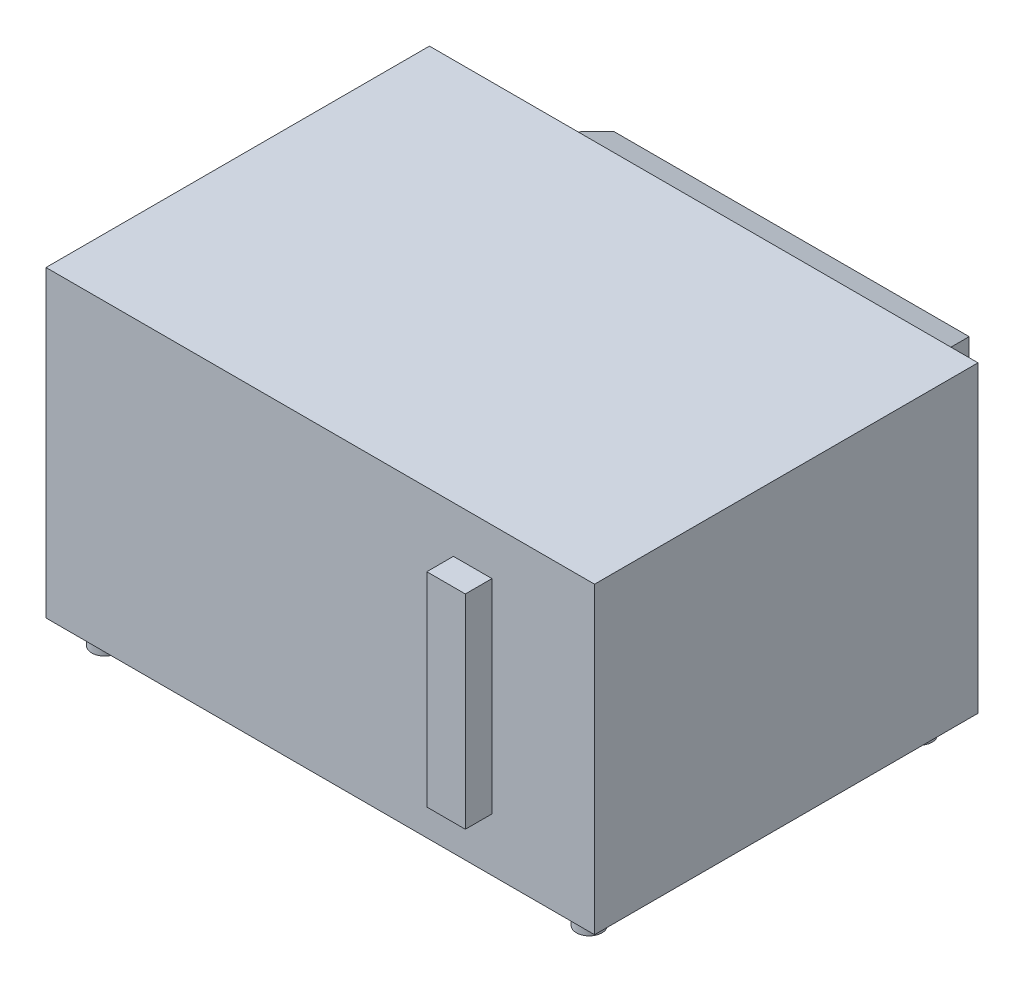
ISO-10303-21;
HEADER;
FILE_DESCRIPTION(('STEP AP214'),'2;1');
FILE_NAME('part.step','',(''),(''),'','','');
FILE_SCHEMA(('AUTOMOTIVE_DESIGN { 1 0 10303 214 1 1 1 1 }'));
ENDSEC;
DATA;
#1=APPLICATION_CONTEXT('core data for automotive mechanical design processes');
#2=APPLICATION_PROTOCOL_DEFINITION('international standard','automotive_design',2000,#1);
#3=PRODUCT_CONTEXT('',#1,'mechanical');
#4=PRODUCT('Part','Part','',(#3));
#5=PRODUCT_RELATED_PRODUCT_CATEGORY('part','',(#4));
#6=PRODUCT_DEFINITION_FORMATION('','',#4);
#7=PRODUCT_DEFINITION_CONTEXT('part definition',#1,'design');
#8=PRODUCT_DEFINITION('design','',#6,#7);
#9=PRODUCT_DEFINITION_SHAPE('','',#8);
#10=(LENGTH_UNIT() NAMED_UNIT(*) SI_UNIT(.MILLI.,.METRE.));
#11=(NAMED_UNIT(*) PLANE_ANGLE_UNIT() SI_UNIT($,.RADIAN.));
#12=(NAMED_UNIT(*) SI_UNIT($,.STERADIAN.) SOLID_ANGLE_UNIT());
#13=UNCERTAINTY_MEASURE_WITH_UNIT(LENGTH_MEASURE(1.E-05),#10,'distance_accuracy_value','');
#14=(GEOMETRIC_REPRESENTATION_CONTEXT(3) GLOBAL_UNCERTAINTY_ASSIGNED_CONTEXT((#13)) GLOBAL_UNIT_ASSIGNED_CONTEXT((#10,
#11,#12)) REPRESENTATION_CONTEXT('',''));
#15=CARTESIAN_POINT('',(0.,0.,0.));
#16=DIRECTION('',(0.,0.,1.));
#17=DIRECTION('',(1.,0.,0.));
#18=AXIS2_PLACEMENT_3D('',#15,#16,#17);
#19=CARTESIAN_POINT('',(0.,285.,-360.));
#20=DIRECTION('',(0.,0.,1.));
#21=DIRECTION('',(1.,0.,0.));
#22=AXIS2_PLACEMENT_3D('',#19,#20,#21);
#23=PLANE('',#22);
#24=DIRECTION('',(-1.,0.,0.));
#25=VECTOR('',#24,1.);
#26=CARTESIAN_POINT('',(0.,0.,-360.));
#27=LINE('',#26,#25);
#28=CARTESIAN_POINT('',(515.,0.,-360.));
#29=VERTEX_POINT('',#28);
#30=CARTESIAN_POINT('',(0.,0.,-360.));
#31=VERTEX_POINT('',#30);
#32=EDGE_CURVE('E216',#29,#31,#27,.T.);
#33=ORIENTED_EDGE('',*,*,#32,.T.);
#34=DIRECTION('',(0.,-1.,0.));
#35=VECTOR('',#34,1.);
#36=CARTESIAN_POINT('',(0.,285.,-360.));
#37=LINE('',#36,#35);
#38=CARTESIAN_POINT('',(0.,285.,-360.));
#39=VERTEX_POINT('',#38);
#40=EDGE_CURVE('E222',#39,#31,#37,.T.);
#41=ORIENTED_EDGE('',*,*,#40,.F.);
#42=DIRECTION('',(-1.,0.,0.));
#43=VECTOR('',#42,1.);
#44=CARTESIAN_POINT('',(0.,285.,-360.));
#45=LINE('',#44,#43);
#46=CARTESIAN_POINT('',(515.,285.,-360.));
#47=VERTEX_POINT('',#46);
#48=EDGE_CURVE('E220',#47,#39,#45,.T.);
#49=ORIENTED_EDGE('',*,*,#48,.F.);
#50=DIRECTION('',(0.,-1.,0.));
#51=VECTOR('',#50,1.);
#52=CARTESIAN_POINT('',(515.,285.,-360.));
#53=LINE('',#52,#51);
#54=EDGE_CURVE('E232',#47,#29,#53,.T.);
#55=ORIENTED_EDGE('',*,*,#54,.T.);
#56=EDGE_LOOP('',(#33,#41,#49,#55));
#57=FACE_BOUND('',#56,.T.);
#58=DIRECTION('',(0.,-1.,0.));
#59=VECTOR('',#58,1.);
#60=CARTESIAN_POINT('',(449.339882770603,56.0970078059777,-360.));
#61=LINE('',#60,#59);
#62=CARTESIAN_POINT('',(449.339882770603,244.765983423347,-360.));
#63=VERTEX_POINT('',#62);
#64=CARTESIAN_POINT('',(449.339882770603,56.0970078059777,-360.));
#65=VERTEX_POINT('',#64);
#66=EDGE_CURVE('E51',#63,#65,#61,.T.);
#67=ORIENTED_EDGE('',*,*,#66,.F.);
#68=DIRECTION('',(1.,0.,0.));
#69=VECTOR('',#68,1.);
#70=CARTESIAN_POINT('',(449.339882770603,244.765983423347,-360.));
#71=LINE('',#70,#69);
#72=CARTESIAN_POINT('',(60.3752719740087,244.765983423347,-360.));
#73=VERTEX_POINT('',#72);
#74=EDGE_CURVE('E55',#73,#63,#71,.T.);
#75=ORIENTED_EDGE('',*,*,#74,.F.);
#76=DIRECTION('',(0.,1.,0.));
#77=VECTOR('',#76,1.);
#78=CARTESIAN_POINT('',(60.3752719740087,56.0970078059777,-360.));
#79=LINE('',#78,#77);
#80=CARTESIAN_POINT('',(60.3752719740087,56.0970078059777,-360.));
#81=VERTEX_POINT('',#80);
#82=EDGE_CURVE('E120',#81,#73,#79,.T.);
#83=ORIENTED_EDGE('',*,*,#82,.F.);
#84=DIRECTION('',(-1.,0.,0.));
#85=VECTOR('',#84,1.);
#86=CARTESIAN_POINT('',(449.339882770603,56.0970078059777,-360.));
#87=LINE('',#86,#85);
#88=EDGE_CURVE('E122',#65,#81,#87,.T.);
#89=ORIENTED_EDGE('',*,*,#88,.F.);
#90=EDGE_LOOP('',(#67,#75,#83,#89));
#91=FACE_BOUND('',#90,.T.);
#92=ADVANCED_FACE('F36',(#57,#91),#23,.F.);
#93=CARTESIAN_POINT('',(0.,285.,0.));
#94=DIRECTION('',(0.,0.,-1.));
#95=DIRECTION('',(-1.,0.,0.));
#96=AXIS2_PLACEMENT_3D('',#93,#94,#95);
#97=PLANE('',#96);
#98=DIRECTION('',(1.,0.,0.));
#99=VECTOR('',#98,1.);
#100=CARTESIAN_POINT('',(0.,0.,0.));
#101=LINE('',#100,#99);
#102=CARTESIAN_POINT('',(0.,0.,0.));
#103=VERTEX_POINT('',#102);
#104=CARTESIAN_POINT('',(515.,0.,0.));
#105=VERTEX_POINT('',#104);
#106=EDGE_CURVE('E225',#103,#105,#101,.T.);
#107=ORIENTED_EDGE('',*,*,#106,.T.);
#108=DIRECTION('',(0.,-1.,0.));
#109=VECTOR('',#108,1.);
#110=CARTESIAN_POINT('',(515.,285.,0.));
#111=LINE('',#110,#109);
#112=CARTESIAN_POINT('',(515.,285.,0.));
#113=VERTEX_POINT('',#112);
#114=EDGE_CURVE('E44',#113,#105,#111,.T.);
#115=ORIENTED_EDGE('',*,*,#114,.F.);
#116=DIRECTION('',(1.,0.,0.));
#117=VECTOR('',#116,1.);
#118=CARTESIAN_POINT('',(0.,285.,0.));
#119=LINE('',#118,#117);
#120=CARTESIAN_POINT('',(0.,285.,0.));
#121=VERTEX_POINT('',#120);
#122=EDGE_CURVE('E215',#121,#113,#119,.T.);
#123=ORIENTED_EDGE('',*,*,#122,.F.);
#124=DIRECTION('',(0.,-1.,0.));
#125=VECTOR('',#124,1.);
#126=CARTESIAN_POINT('',(0.,285.,0.));
#127=LINE('',#126,#125);
#128=EDGE_CURVE('E11',#121,#103,#127,.T.);
#129=ORIENTED_EDGE('',*,*,#128,.T.);
#130=EDGE_LOOP('',(#107,#115,#123,#129));
#131=FACE_BOUND('',#130,.T.);
#132=DIRECTION('',(0.,-1.,0.));
#133=VECTOR('',#132,1.);
#134=CARTESIAN_POINT('',(382.512593838522,241.397812036806,0.));
#135=LINE('',#134,#133);
#136=CARTESIAN_POINT('',(382.512593838522,241.397812036806,0.));
#137=VERTEX_POINT('',#136);
#138=CARTESIAN_POINT('',(382.512593838522,50.0706765226009,0.));
#139=VERTEX_POINT('',#138);
#140=EDGE_CURVE('E141',#137,#139,#135,.T.);
#141=ORIENTED_EDGE('',*,*,#140,.F.);
#142=DIRECTION('',(-1.,0.,0.));
#143=VECTOR('',#142,1.);
#144=CARTESIAN_POINT('',(382.512593838522,241.397812036806,0.));
#145=LINE('',#144,#143);
#146=CARTESIAN_POINT('',(418.687780289349,241.397812036806,0.));
#147=VERTEX_POINT('',#146);
#148=EDGE_CURVE('E159',#147,#137,#145,.T.);
#149=ORIENTED_EDGE('',*,*,#148,.F.);
#150=DIRECTION('',(0.,1.,0.));
#151=VECTOR('',#150,1.);
#152=CARTESIAN_POINT('',(418.687780289349,241.397812036806,0.));
#153=LINE('',#152,#151);
#154=CARTESIAN_POINT('',(418.68778028935,50.0706765226009,0.));
#155=VERTEX_POINT('',#154);
#156=EDGE_CURVE('E171',#155,#147,#153,.T.);
#157=ORIENTED_EDGE('',*,*,#156,.F.);
#158=DIRECTION('',(1.,0.,0.));
#159=VECTOR('',#158,1.);
#160=CARTESIAN_POINT('',(382.512593838522,50.0706765226009,0.));
#161=LINE('',#160,#159);
#162=EDGE_CURVE('E168',#139,#155,#161,.T.);
#163=ORIENTED_EDGE('',*,*,#162,.F.);
#164=EDGE_LOOP('',(#141,#149,#157,#163));
#165=FACE_BOUND('',#164,.T.);
#166=ADVANCED_FACE('F254',(#131,#165),#97,.F.);
#167=CARTESIAN_POINT('',(0.,285.,0.));
#168=DIRECTION('',(1.,0.,0.));
#169=DIRECTION('',(0.,0.,-1.));
#170=AXIS2_PLACEMENT_3D('',#167,#168,#169);
#171=PLANE('',#170);
#172=DIRECTION('',(0.,0.,1.));
#173=VECTOR('',#172,1.);
#174=CARTESIAN_POINT('',(0.,0.,0.));
#175=LINE('',#174,#173);
#176=EDGE_CURVE('E209',#31,#103,#175,.T.);
#177=ORIENTED_EDGE('',*,*,#176,.T.);
#178=ORIENTED_EDGE('',*,*,#128,.F.);
#179=DIRECTION('',(0.,0.,1.));
#180=VECTOR('',#179,1.);
#181=CARTESIAN_POINT('',(0.,285.,0.));
#182=LINE('',#181,#180);
#183=EDGE_CURVE('E212',#39,#121,#182,.T.);
#184=ORIENTED_EDGE('',*,*,#183,.F.);
#185=ORIENTED_EDGE('',*,*,#40,.T.);
#186=EDGE_LOOP('',(#177,#178,#184,#185));
#187=FACE_BOUND('',#186,.T.);
#188=ADVANCED_FACE('F38',(#187),#171,.F.);
#189=CARTESIAN_POINT('',(515.,285.,0.));
#190=DIRECTION('',(-1.,0.,0.));
#191=DIRECTION('',(0.,0.,1.));
#192=AXIS2_PLACEMENT_3D('',#189,#190,#191);
#193=PLANE('',#192);
#194=DIRECTION('',(0.,0.,-1.));
#195=VECTOR('',#194,1.);
#196=CARTESIAN_POINT('',(515.,0.,0.));
#197=LINE('',#196,#195);
#198=EDGE_CURVE('E227',#105,#29,#197,.T.);
#199=ORIENTED_EDGE('',*,*,#198,.T.);
#200=ORIENTED_EDGE('',*,*,#54,.F.);
#201=DIRECTION('',(0.,0.,-1.));
#202=VECTOR('',#201,1.);
#203=CARTESIAN_POINT('',(515.,285.,0.));
#204=LINE('',#203,#202);
#205=EDGE_CURVE('E218',#113,#47,#204,.T.);
#206=ORIENTED_EDGE('',*,*,#205,.F.);
#207=ORIENTED_EDGE('',*,*,#114,.T.);
#208=EDGE_LOOP('',(#199,#200,#206,#207));
#209=FACE_BOUND('',#208,.T.);
#210=ADVANCED_FACE('F239',(#209),#193,.F.);
#211=CARTESIAN_POINT('',(0.,285.,0.));
#212=DIRECTION('',(0.,-1.,0.));
#213=DIRECTION('',(0.,0.,-1.));
#214=AXIS2_PLACEMENT_3D('',#211,#212,#213);
#215=PLANE('',#214);
#216=ORIENTED_EDGE('',*,*,#183,.T.);
#217=ORIENTED_EDGE('',*,*,#122,.T.);
#218=ORIENTED_EDGE('',*,*,#205,.T.);
#219=ORIENTED_EDGE('',*,*,#48,.T.);
#220=EDGE_LOOP('',(#216,#217,#218,#219));
#221=FACE_BOUND('',#220,.T.);
#222=ADVANCED_FACE('F253',(#221),#215,.F.);
#223=CARTESIAN_POINT('',(0.,0.,0.));
#224=DIRECTION('',(0.,-1.,0.));
#225=DIRECTION('',(0.,0.,-1.));
#226=AXIS2_PLACEMENT_3D('',#223,#224,#225);
#227=PLANE('',#226);
#228=CARTESIAN_POINT('',(485.,0.,-24.9999999999999));
#229=DIRECTION('',(0.,-1.,0.));
#230=DIRECTION('',(0.,0.,1.));
#231=AXIS2_PLACEMENT_3D('',#228,#229,#230);
#232=CIRCLE('',#231,12.);
#233=CARTESIAN_POINT('',(485.,0.,-13.));
#234=VERTEX_POINT('',#233);
#235=EDGE_CURVE('E187',#234,#234,#232,.T.);
#236=ORIENTED_EDGE('',*,*,#235,.F.);
#237=EDGE_LOOP('',(#236));
#238=FACE_BOUND('',#237,.T.);
#239=CARTESIAN_POINT('',(485.,0.,-335.));
#240=DIRECTION('',(0.,-1.,0.));
#241=DIRECTION('',(0.,0.,-1.));
#242=AXIS2_PLACEMENT_3D('',#239,#240,#241);
#243=CIRCLE('',#242,12.);
#244=CARTESIAN_POINT('',(485.,0.,-347.));
#245=VERTEX_POINT('',#244);
#246=EDGE_CURVE('E191',#245,#245,#243,.T.);
#247=ORIENTED_EDGE('',*,*,#246,.F.);
#248=EDGE_LOOP('',(#247));
#249=FACE_BOUND('',#248,.T.);
#250=CARTESIAN_POINT('',(30.,0.,-335.));
#251=DIRECTION('',(0.,-1.,0.));
#252=DIRECTION('',(0.,0.,1.));
#253=AXIS2_PLACEMENT_3D('',#250,#251,#252);
#254=CIRCLE('',#253,12.);
#255=CARTESIAN_POINT('',(30.,0.,-323.));
#256=VERTEX_POINT('',#255);
#257=EDGE_CURVE('E197',#256,#256,#254,.T.);
#258=ORIENTED_EDGE('',*,*,#257,.F.);
#259=EDGE_LOOP('',(#258));
#260=FACE_BOUND('',#259,.T.);
#261=CARTESIAN_POINT('',(30.,0.,-25.));
#262=DIRECTION('',(0.,-1.,0.));
#263=DIRECTION('',(0.,0.,-1.));
#264=AXIS2_PLACEMENT_3D('',#261,#262,#263);
#265=CIRCLE('',#264,12.);
#266=CARTESIAN_POINT('',(30.,0.,-37.));
#267=VERTEX_POINT('',#266);
#268=EDGE_CURVE('E203',#267,#267,#265,.T.);
#269=ORIENTED_EDGE('',*,*,#268,.F.);
#270=EDGE_LOOP('',(#269));
#271=FACE_BOUND('',#270,.T.);
#272=ORIENTED_EDGE('',*,*,#176,.F.);
#273=ORIENTED_EDGE('',*,*,#32,.F.);
#274=ORIENTED_EDGE('',*,*,#198,.F.);
#275=ORIENTED_EDGE('',*,*,#106,.F.);
#276=EDGE_LOOP('',(#272,#273,#274,#275));
#277=FACE_BOUND('',#276,.T.);
#278=ADVANCED_FACE('F245',(#238,#249,#260,#271,#277),#227,.T.);
#279=CARTESIAN_POINT('',(30.,-20.,-25.));
#280=DIRECTION('',(0.,1.,0.));
#281=DIRECTION('',(0.,0.,1.));
#282=AXIS2_PLACEMENT_3D('',#279,#280,#281);
#283=CYLINDRICAL_SURFACE('',#282,12.);
#284=CARTESIAN_POINT('',(30.,-20.,-25.));
#285=DIRECTION('',(0.,-1.,0.));
#286=DIRECTION('',(0.,0.,-1.));
#287=AXIS2_PLACEMENT_3D('',#284,#285,#286);
#288=CIRCLE('',#287,12.);
#289=CARTESIAN_POINT('',(30.,-20.,-37.));
#290=VERTEX_POINT('',#289);
#291=EDGE_CURVE('E206',#290,#290,#288,.T.);
#292=ORIENTED_EDGE('',*,*,#291,.F.);
#293=EDGE_LOOP('',(#292));
#294=FACE_BOUND('',#293,.T.);
#295=ORIENTED_EDGE('',*,*,#268,.T.);
#296=EDGE_LOOP('',(#295));
#297=FACE_BOUND('',#296,.T.);
#298=ADVANCED_FACE('F445',(#294,#297),#283,.T.);
#299=CARTESIAN_POINT('',(30.,-20.,-25.));
#300=DIRECTION('',(0.,-1.,0.));
#301=DIRECTION('',(0.,0.,-1.));
#302=AXIS2_PLACEMENT_3D('',#299,#300,#301);
#303=PLANE('',#302);
#304=ORIENTED_EDGE('',*,*,#291,.T.);
#305=EDGE_LOOP('',(#304));
#306=FACE_BOUND('',#305,.T.);
#307=ADVANCED_FACE('F437',(#306),#303,.T.);
#308=CARTESIAN_POINT('',(30.,-20.,-335.));
#309=DIRECTION('',(0.,1.,0.));
#310=DIRECTION('',(0.,0.,1.));
#311=AXIS2_PLACEMENT_3D('',#308,#309,#310);
#312=CYLINDRICAL_SURFACE('',#311,12.);
#313=CARTESIAN_POINT('',(30.,-20.,-335.));
#314=DIRECTION('',(0.,-1.,0.));
#315=DIRECTION('',(0.,0.,1.));
#316=AXIS2_PLACEMENT_3D('',#313,#314,#315);
#317=CIRCLE('',#316,12.);
#318=CARTESIAN_POINT('',(30.,-20.,-323.));
#319=VERTEX_POINT('',#318);
#320=EDGE_CURVE('E200',#319,#319,#317,.T.);
#321=ORIENTED_EDGE('',*,*,#320,.F.);
#322=EDGE_LOOP('',(#321));
#323=FACE_BOUND('',#322,.T.);
#324=ORIENTED_EDGE('',*,*,#257,.T.);
#325=EDGE_LOOP('',(#324));
#326=FACE_BOUND('',#325,.T.);
#327=ADVANCED_FACE('F429',(#323,#326),#312,.T.);
#328=CARTESIAN_POINT('',(30.,-20.,-335.));
#329=DIRECTION('',(0.,1.,0.));
#330=DIRECTION('',(0.,0.,1.));
#331=AXIS2_PLACEMENT_3D('',#328,#329,#330);
#332=PLANE('',#331);
#333=ORIENTED_EDGE('',*,*,#320,.T.);
#334=EDGE_LOOP('',(#333));
#335=FACE_BOUND('',#334,.T.);
#336=ADVANCED_FACE('F421',(#335),#332,.F.);
#337=CARTESIAN_POINT('',(485.,-20.,-335.));
#338=DIRECTION('',(0.,1.,0.));
#339=DIRECTION('',(0.,0.,1.));
#340=AXIS2_PLACEMENT_3D('',#337,#338,#339);
#341=CYLINDRICAL_SURFACE('',#340,12.);
#342=CARTESIAN_POINT('',(485.,-20.,-335.));
#343=DIRECTION('',(0.,-1.,0.));
#344=DIRECTION('',(0.,0.,-1.));
#345=AXIS2_PLACEMENT_3D('',#342,#343,#344);
#346=CIRCLE('',#345,12.);
#347=CARTESIAN_POINT('',(485.,-20.,-347.));
#348=VERTEX_POINT('',#347);
#349=EDGE_CURVE('E194',#348,#348,#346,.T.);
#350=ORIENTED_EDGE('',*,*,#349,.F.);
#351=EDGE_LOOP('',(#350));
#352=FACE_BOUND('',#351,.T.);
#353=ORIENTED_EDGE('',*,*,#246,.T.);
#354=EDGE_LOOP('',(#353));
#355=FACE_BOUND('',#354,.T.);
#356=ADVANCED_FACE('F413',(#352,#355),#341,.T.);
#357=CARTESIAN_POINT('',(485.,-20.,-335.));
#358=DIRECTION('',(0.,-1.,0.));
#359=DIRECTION('',(0.,0.,-1.));
#360=AXIS2_PLACEMENT_3D('',#357,#358,#359);
#361=PLANE('',#360);
#362=ORIENTED_EDGE('',*,*,#349,.T.);
#363=EDGE_LOOP('',(#362));
#364=FACE_BOUND('',#363,.T.);
#365=ADVANCED_FACE('F405',(#364),#361,.T.);
#366=CARTESIAN_POINT('',(485.,-20.,-24.9999999999999));
#367=DIRECTION('',(0.,1.,0.));
#368=DIRECTION('',(0.,0.,1.));
#369=AXIS2_PLACEMENT_3D('',#366,#367,#368);
#370=CYLINDRICAL_SURFACE('',#369,12.);
#371=CARTESIAN_POINT('',(485.,-20.,-24.9999999999999));
#372=DIRECTION('',(0.,-1.,0.));
#373=DIRECTION('',(0.,0.,1.));
#374=AXIS2_PLACEMENT_3D('',#371,#372,#373);
#375=CIRCLE('',#374,12.);
#376=CARTESIAN_POINT('',(485.,-20.,-13.));
#377=VERTEX_POINT('',#376);
#378=EDGE_CURVE('E188',#377,#377,#375,.T.);
#379=ORIENTED_EDGE('',*,*,#378,.F.);
#380=EDGE_LOOP('',(#379));
#381=FACE_BOUND('',#380,.T.);
#382=ORIENTED_EDGE('',*,*,#235,.T.);
#383=EDGE_LOOP('',(#382));
#384=FACE_BOUND('',#383,.T.);
#385=ADVANCED_FACE('F400',(#381,#384),#370,.T.);
#386=CARTESIAN_POINT('',(485.,-20.,-24.9999999999999));
#387=DIRECTION('',(0.,1.,0.));
#388=DIRECTION('',(0.,0.,1.));
#389=AXIS2_PLACEMENT_3D('',#386,#387,#388);
#390=PLANE('',#389);
#391=ORIENTED_EDGE('',*,*,#378,.T.);
#392=EDGE_LOOP('',(#391));
#393=FACE_BOUND('',#392,.T.);
#394=ADVANCED_FACE('F281',(#393),#390,.F.);
#395=CARTESIAN_POINT('',(382.512593838522,241.397812036806,25.));
#396=DIRECTION('',(1.,0.,0.));
#397=DIRECTION('',(0.,0.,-1.));
#398=AXIS2_PLACEMENT_3D('',#395,#396,#397);
#399=PLANE('',#398);
#400=ORIENTED_EDGE('',*,*,#140,.T.);
#401=DIRECTION('',(0.,0.,-1.));
#402=VECTOR('',#401,1.);
#403=CARTESIAN_POINT('',(382.512593838522,50.0706765226009,25.));
#404=LINE('',#403,#402);
#405=CARTESIAN_POINT('',(382.512593838522,50.0706765226009,25.));
#406=VERTEX_POINT('',#405);
#407=EDGE_CURVE('E184',#406,#139,#404,.T.);
#408=ORIENTED_EDGE('',*,*,#407,.F.);
#409=DIRECTION('',(0.,-1.,0.));
#410=VECTOR('',#409,1.);
#411=CARTESIAN_POINT('',(382.512593838522,241.397812036806,25.));
#412=LINE('',#411,#410);
#413=CARTESIAN_POINT('',(382.512593838522,241.397812036806,25.));
#414=VERTEX_POINT('',#413);
#415=EDGE_CURVE('E155',#414,#406,#412,.T.);
#416=ORIENTED_EDGE('',*,*,#415,.F.);
#417=DIRECTION('',(0.,0.,-1.));
#418=VECTOR('',#417,1.);
#419=CARTESIAN_POINT('',(382.512593838522,241.397812036806,25.));
#420=LINE('',#419,#418);
#421=EDGE_CURVE('E165',#414,#137,#420,.T.);
#422=ORIENTED_EDGE('',*,*,#421,.T.);
#423=EDGE_LOOP('',(#400,#408,#416,#422));
#424=FACE_BOUND('',#423,.T.);
#425=ADVANCED_FACE('F265',(#424),#399,.F.);
#426=CARTESIAN_POINT('',(382.512593838522,50.0706765226009,25.));
#427=DIRECTION('',(0.,1.,0.));
#428=DIRECTION('',(0.,0.,1.));
#429=AXIS2_PLACEMENT_3D('',#426,#427,#428);
#430=PLANE('',#429);
#431=ORIENTED_EDGE('',*,*,#162,.T.);
#432=DIRECTION('',(0.,0.,-1.));
#433=VECTOR('',#432,1.);
#434=CARTESIAN_POINT('',(418.68778028935,50.0706765226009,25.));
#435=LINE('',#434,#433);
#436=CARTESIAN_POINT('',(418.68778028935,50.0706765226009,25.));
#437=VERTEX_POINT('',#436);
#438=EDGE_CURVE('E181',#437,#155,#435,.T.);
#439=ORIENTED_EDGE('',*,*,#438,.F.);
#440=DIRECTION('',(1.,0.,0.));
#441=VECTOR('',#440,1.);
#442=CARTESIAN_POINT('',(382.512593838522,50.0706765226009,25.));
#443=LINE('',#442,#441);
#444=EDGE_CURVE('E158',#406,#437,#443,.T.);
#445=ORIENTED_EDGE('',*,*,#444,.F.);
#446=ORIENTED_EDGE('',*,*,#407,.T.);
#447=EDGE_LOOP('',(#431,#439,#445,#446));
#448=FACE_BOUND('',#447,.T.);
#449=ADVANCED_FACE('F273',(#448),#430,.F.);
#450=CARTESIAN_POINT('',(418.687780289349,241.397812036806,25.));
#451=DIRECTION('',(-1.,0.,0.));
#452=DIRECTION('',(0.,-1.,0.));
#453=AXIS2_PLACEMENT_3D('',#450,#451,#452);
#454=PLANE('',#453);
#455=ORIENTED_EDGE('',*,*,#156,.T.);
#456=DIRECTION('',(0.,0.,-1.));
#457=VECTOR('',#456,1.);
#458=CARTESIAN_POINT('',(418.687780289349,241.397812036806,25.));
#459=LINE('',#458,#457);
#460=CARTESIAN_POINT('',(418.687780289349,241.397812036806,25.));
#461=VERTEX_POINT('',#460);
#462=EDGE_CURVE('E178',#461,#147,#459,.T.);
#463=ORIENTED_EDGE('',*,*,#462,.F.);
#464=DIRECTION('',(0.,1.,0.));
#465=VECTOR('',#464,1.);
#466=CARTESIAN_POINT('',(418.687780289349,241.397812036806,25.));
#467=LINE('',#466,#465);
#468=EDGE_CURVE('E161',#437,#461,#467,.T.);
#469=ORIENTED_EDGE('',*,*,#468,.F.);
#470=ORIENTED_EDGE('',*,*,#438,.T.);
#471=EDGE_LOOP('',(#455,#463,#469,#470));
#472=FACE_BOUND('',#471,.T.);
#473=ADVANCED_FACE('F271',(#472),#454,.F.);
#474=CARTESIAN_POINT('',(382.512593838522,241.397812036806,25.));
#475=DIRECTION('',(0.,-1.,0.));
#476=DIRECTION('',(0.,0.,-1.));
#477=AXIS2_PLACEMENT_3D('',#474,#475,#476);
#478=PLANE('',#477);
#479=ORIENTED_EDGE('',*,*,#148,.T.);
#480=ORIENTED_EDGE('',*,*,#421,.F.);
#481=DIRECTION('',(-1.,0.,0.));
#482=VECTOR('',#481,1.);
#483=CARTESIAN_POINT('',(382.512593838522,241.397812036806,25.));
#484=LINE('',#483,#482);
#485=EDGE_CURVE('E163',#461,#414,#484,.T.);
#486=ORIENTED_EDGE('',*,*,#485,.F.);
#487=ORIENTED_EDGE('',*,*,#462,.T.);
#488=EDGE_LOOP('',(#479,#480,#486,#487));
#489=FACE_BOUND('',#488,.T.);
#490=ADVANCED_FACE('F261',(#489),#478,.F.);
#491=CARTESIAN_POINT('',(0.,0.,25.));
#492=DIRECTION('',(0.,0.,1.));
#493=DIRECTION('',(1.,0.,0.));
#494=AXIS2_PLACEMENT_3D('',#491,#492,#493);
#495=PLANE('',#494);
#496=ORIENTED_EDGE('',*,*,#415,.T.);
#497=ORIENTED_EDGE('',*,*,#444,.T.);
#498=ORIENTED_EDGE('',*,*,#468,.T.);
#499=ORIENTED_EDGE('',*,*,#485,.T.);
#500=EDGE_LOOP('',(#496,#497,#498,#499));
#501=FACE_BOUND('',#500,.T.);
#502=ADVANCED_FACE('F267',(#501),#495,.T.);
#503=CARTESIAN_POINT('',(449.339882770603,56.0970078059777,-360.));
#504=DIRECTION('',(0.951056516295154,0.,-0.309016994374948));
#505=DIRECTION('',(-0.309016994374948,0.,-0.951056516295154));
#506=AXIS2_PLACEMENT_3D('',#503,#504,#505);
#507=PLANE('',#506);
#508=ORIENTED_EDGE('',*,*,#66,.T.);
#509=DIRECTION('',(0.295241808844326,-0.295241808844326,0.908660854566026));
#510=VECTOR('',#509,1.);
#511=CARTESIAN_POINT('',(449.339882770603,56.0970078059777,-360.));
#512=LINE('',#511,#510);
#513=CARTESIAN_POINT('',(421.721708590806,83.7151819857747,-445.));
#514=VERTEX_POINT('',#513);
#515=EDGE_CURVE('E135',#514,#65,#512,.T.);
#516=ORIENTED_EDGE('',*,*,#515,.F.);
#517=DIRECTION('',(0.,1.,0.));
#518=VECTOR('',#517,1.);
#519=CARTESIAN_POINT('',(421.721708590806,0.,-445.));
#520=LINE('',#519,#518);
#521=CARTESIAN_POINT('',(421.721708590806,217.14780924355,-445.));
#522=VERTEX_POINT('',#521);
#523=EDGE_CURVE('E147',#522,#514,#520,.F.);
#524=ORIENTED_EDGE('',*,*,#523,.F.);
#525=DIRECTION('',(0.295241808844326,0.295241808844326,0.908660854566026));
#526=VECTOR('',#525,1.);
#527=CARTESIAN_POINT('',(432.894037257837,228.320137910582,-410.615107989567));
#528=LINE('',#527,#526);
#529=EDGE_CURVE('E143',#522,#63,#528,.T.);
#530=ORIENTED_EDGE('',*,*,#529,.T.);
#531=EDGE_LOOP('',(#508,#516,#524,#530));
#532=FACE_BOUND('',#531,.T.);
#533=ADVANCED_FACE('F338',(#532),#507,.T.);
#534=CARTESIAN_POINT('',(449.339882770603,56.0970078059777,-360.));
#535=DIRECTION('',(0.,-0.951056516295154,-0.309016994374948));
#536=DIRECTION('',(0.,0.309016994374948,-0.951056516295154));
#537=AXIS2_PLACEMENT_3D('',#534,#535,#536);
#538=PLANE('',#537);
#539=ORIENTED_EDGE('',*,*,#88,.T.);
#540=DIRECTION('',(-0.295241808844326,-0.295241808844326,0.908660854566026));
#541=VECTOR('',#540,1.);
#542=CARTESIAN_POINT('',(60.3752719740087,56.0970078059777,-360.));
#543=LINE('',#542,#541);
#544=CARTESIAN_POINT('',(87.9934461538057,83.7151819857747,-445.));
#545=VERTEX_POINT('',#544);
#546=EDGE_CURVE('E132',#545,#81,#543,.T.);
#547=ORIENTED_EDGE('',*,*,#546,.F.);
#548=DIRECTION('',(1.,0.,0.));
#549=VECTOR('',#548,1.);
#550=CARTESIAN_POINT('',(0.,83.7151819857747,-445.));
#551=LINE('',#550,#549);
#552=EDGE_CURVE('E150',#514,#545,#551,.F.);
#553=ORIENTED_EDGE('',*,*,#552,.F.);
#554=ORIENTED_EDGE('',*,*,#515,.T.);
#555=EDGE_LOOP('',(#539,#547,#553,#554));
#556=FACE_BOUND('',#555,.T.);
#557=ADVANCED_FACE('F131',(#556),#538,.T.);
#558=CARTESIAN_POINT('',(60.3752719740087,56.0970078059777,-360.));
#559=DIRECTION('',(-0.951056516295154,0.,-0.309016994374948));
#560=DIRECTION('',(-0.309016994374948,0.,0.951056516295154));
#561=AXIS2_PLACEMENT_3D('',#558,#559,#560);
#562=PLANE('',#561);
#563=ORIENTED_EDGE('',*,*,#82,.T.);
#564=DIRECTION('',(-0.295241808844326,0.295241808844326,0.908660854566026));
#565=VECTOR('',#564,1.);
#566=CARTESIAN_POINT('',(94.2804324709154,210.860822926441,-464.349354286614));
#567=LINE('',#566,#565);
#568=CARTESIAN_POINT('',(87.9934461538057,217.14780924355,-445.));
#569=VERTEX_POINT('',#568);
#570=EDGE_CURVE('E139',#569,#73,#567,.T.);
#571=ORIENTED_EDGE('',*,*,#570,.F.);
#572=DIRECTION('',(0.,-1.,0.));
#573=VECTOR('',#572,1.);
#574=CARTESIAN_POINT('',(87.9934461538057,0.,-445.));
#575=LINE('',#574,#573);
#576=EDGE_CURVE('E138',#545,#569,#575,.F.);
#577=ORIENTED_EDGE('',*,*,#576,.F.);
#578=ORIENTED_EDGE('',*,*,#546,.T.);
#579=EDGE_LOOP('',(#563,#571,#577,#578));
#580=FACE_BOUND('',#579,.T.);
#581=ADVANCED_FACE('F137',(#580),#562,.T.);
#582=CARTESIAN_POINT('',(449.339882770603,244.765983423347,-360.));
#583=DIRECTION('',(0.,0.951056516295154,-0.309016994374948));
#584=DIRECTION('',(0.,0.309016994374948,0.951056516295154));
#585=AXIS2_PLACEMENT_3D('',#582,#583,#584);
#586=PLANE('',#585);
#587=ORIENTED_EDGE('',*,*,#74,.T.);
#588=ORIENTED_EDGE('',*,*,#529,.F.);
#589=DIRECTION('',(-1.,0.,0.));
#590=VECTOR('',#589,1.);
#591=CARTESIAN_POINT('',(0.,217.14780924355,-445.));
#592=LINE('',#591,#590);
#593=EDGE_CURVE('E153',#569,#522,#592,.F.);
#594=ORIENTED_EDGE('',*,*,#593,.F.);
#595=ORIENTED_EDGE('',*,*,#570,.T.);
#596=EDGE_LOOP('',(#587,#588,#594,#595));
#597=FACE_BOUND('',#596,.T.);
#598=ADVANCED_FACE('F369',(#597),#586,.T.);
#599=CARTESIAN_POINT('',(0.,0.,-445.));
#600=DIRECTION('',(0.,0.,1.));
#601=DIRECTION('',(1.,0.,0.));
#602=AXIS2_PLACEMENT_3D('',#599,#600,#601);
#603=PLANE('',#602);
#604=ORIENTED_EDGE('',*,*,#523,.T.);
#605=ORIENTED_EDGE('',*,*,#552,.T.);
#606=ORIENTED_EDGE('',*,*,#576,.T.);
#607=ORIENTED_EDGE('',*,*,#593,.T.);
#608=EDGE_LOOP('',(#604,#605,#606,#607));
#609=FACE_BOUND('',#608,.T.);
#610=ADVANCED_FACE('F378',(#609),#603,.F.);
#611=CLOSED_SHELL('',(#92,#166,#188,#210,#222,#278,#298,#307,#327,#336,#356,#365,#385,#394,#425,
#449,#473,#490,#502,#533,#557,#581,#598,#610));
#612=MANIFOLD_SOLID_BREP('B2',#611);
#613=ADVANCED_BREP_SHAPE_REPRESENTATION('',(#18,#612),#14);
#614=SHAPE_DEFINITION_REPRESENTATION(#9,#613);
ENDSEC;
END-ISO-10303-21;
